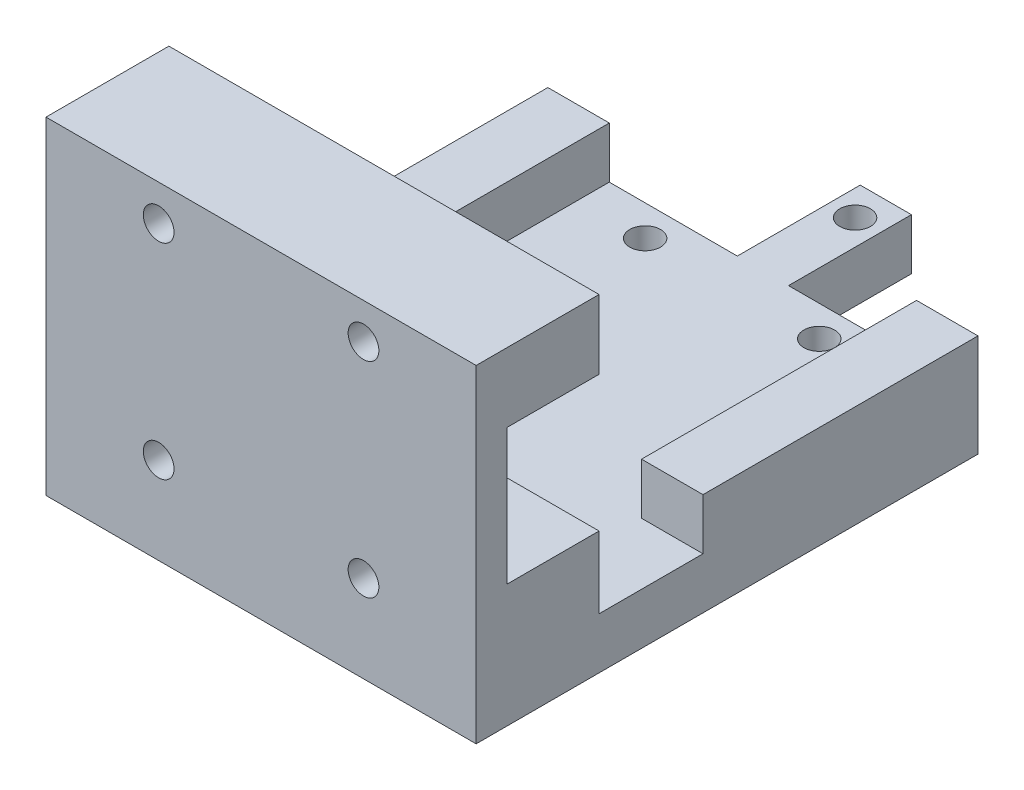
ISO-10303-21;
HEADER;
FILE_DESCRIPTION(('STEP AP214'),'2;1');
FILE_NAME('part.step','',(''),(''),'','','');
FILE_SCHEMA(('AUTOMOTIVE_DESIGN { 1 0 10303 214 1 1 1 1 }'));
ENDSEC;
DATA;
#1=APPLICATION_CONTEXT('core data for automotive mechanical design processes');
#2=APPLICATION_PROTOCOL_DEFINITION('international standard','automotive_design',2000,#1);
#3=PRODUCT_CONTEXT('',#1,'mechanical');
#4=PRODUCT('Part','Part','',(#3));
#5=PRODUCT_RELATED_PRODUCT_CATEGORY('part','',(#4));
#6=PRODUCT_DEFINITION_FORMATION('','',#4);
#7=PRODUCT_DEFINITION_CONTEXT('part definition',#1,'design');
#8=PRODUCT_DEFINITION('design','',#6,#7);
#9=PRODUCT_DEFINITION_SHAPE('','',#8);
#10=(LENGTH_UNIT() NAMED_UNIT(*) SI_UNIT(.MILLI.,.METRE.));
#11=(NAMED_UNIT(*) PLANE_ANGLE_UNIT() SI_UNIT($,.RADIAN.));
#12=(NAMED_UNIT(*) SI_UNIT($,.STERADIAN.) SOLID_ANGLE_UNIT());
#13=UNCERTAINTY_MEASURE_WITH_UNIT(LENGTH_MEASURE(1.E-05),#10,'distance_accuracy_value','');
#14=(GEOMETRIC_REPRESENTATION_CONTEXT(3) GLOBAL_UNCERTAINTY_ASSIGNED_CONTEXT((#13)) GLOBAL_UNIT_ASSIGNED_CONTEXT((#10,
#11,#12)) REPRESENTATION_CONTEXT('',''));
#15=CARTESIAN_POINT('',(0.,0.,0.));
#16=DIRECTION('',(0.,0.,1.));
#17=DIRECTION('',(1.,0.,0.));
#18=AXIS2_PLACEMENT_3D('',#15,#16,#17);
#19=CARTESIAN_POINT('',(-21.,0.,12.));
#20=DIRECTION('',(-1.,0.,0.));
#21=DIRECTION('',(0.,-1.,0.));
#22=AXIS2_PLACEMENT_3D('',#19,#20,#21);
#23=PLANE('',#22);
#24=DIRECTION('',(0.,1.,0.));
#25=VECTOR('',#24,1.);
#26=CARTESIAN_POINT('',(-21.,0.,0.));
#27=LINE('',#26,#25);
#28=CARTESIAN_POINT('',(-21.,6.75,0.));
#29=VERTEX_POINT('',#28);
#30=CARTESIAN_POINT('',(-21.,13.5,0.));
#31=VERTEX_POINT('',#30);
#32=EDGE_CURVE('E79',#29,#31,#27,.T.);
#33=ORIENTED_EDGE('',*,*,#32,.F.);
#34=DIRECTION('',(0.,0.,-1.));
#35=VECTOR('',#34,1.);
#36=CARTESIAN_POINT('',(-21.,6.75,12.));
#37=LINE('',#36,#35);
#38=CARTESIAN_POINT('',(-21.,6.75,9.));
#39=VERTEX_POINT('',#38);
#40=EDGE_CURVE('E11',#39,#29,#37,.T.);
#41=ORIENTED_EDGE('',*,*,#40,.F.);
#42=DIRECTION('',(0.,1.,0.));
#43=VECTOR('',#42,1.);
#44=CARTESIAN_POINT('',(-21.,0.,9.));
#45=LINE('',#44,#43);
#46=CARTESIAN_POINT('',(-21.,-6.5,9.));
#47=VERTEX_POINT('',#46);
#48=EDGE_CURVE('E119',#47,#39,#45,.T.);
#49=ORIENTED_EDGE('',*,*,#48,.F.);
#50=DIRECTION('',(0.,0.,-1.));
#51=VECTOR('',#50,1.);
#52=CARTESIAN_POINT('',(-21.,-6.5,12.));
#53=LINE('',#52,#51);
#54=CARTESIAN_POINT('',(-21.,-6.5,0.));
#55=VERTEX_POINT('',#54);
#56=EDGE_CURVE('E206',#47,#55,#53,.T.);
#57=ORIENTED_EDGE('',*,*,#56,.T.);
#58=DIRECTION('',(0.,-1.,0.));
#59=VECTOR('',#58,1.);
#60=CARTESIAN_POINT('',(-21.,0.,0.));
#61=LINE('',#60,#59);
#62=CARTESIAN_POINT('',(-21.,-13.5,0.));
#63=VERTEX_POINT('',#62);
#64=EDGE_CURVE('E223',#55,#63,#61,.T.);
#65=ORIENTED_EDGE('',*,*,#64,.T.);
#66=DIRECTION('',(0.,0.,-1.));
#67=VECTOR('',#66,1.);
#68=CARTESIAN_POINT('',(-20.9999999999927,-13.5,0.));
#69=LINE('',#68,#67);
#70=CARTESIAN_POINT('',(-20.9999999999927,-13.5,-10.150000000012));
#71=VERTEX_POINT('',#70);
#72=EDGE_CURVE('E259',#63,#71,#69,.T.);
#73=ORIENTED_EDGE('',*,*,#72,.T.);
#74=DIRECTION('',(0.,-1.,0.));
#75=VECTOR('',#74,1.);
#76=CARTESIAN_POINT('',(-20.9999999999927,-8.49999999999999,-10.150000000012));
#77=LINE('',#76,#75);
#78=CARTESIAN_POINT('',(-20.9999999999927,-8.49999999999999,-10.150000000012));
#79=VERTEX_POINT('',#78);
#80=EDGE_CURVE('E278',#79,#71,#77,.T.);
#81=ORIENTED_EDGE('',*,*,#80,.F.);
#82=DIRECTION('',(0.,0.,-1.));
#83=VECTOR('',#82,1.);
#84=CARTESIAN_POINT('',(-20.9999999999927,-8.49999999999999,0.));
#85=LINE('',#84,#83);
#86=CARTESIAN_POINT('',(-20.9999999999927,-8.49999999999999,-36.9999999999998));
#87=VERTEX_POINT('',#86);
#88=EDGE_CURVE('E307',#79,#87,#85,.T.);
#89=ORIENTED_EDGE('',*,*,#88,.T.);
#90=DIRECTION('',(0.,1.,0.));
#91=VECTOR('',#90,1.);
#92=CARTESIAN_POINT('',(-20.9999999999927,-18.5,-36.9999999999998));
#93=LINE('',#92,#91);
#94=CARTESIAN_POINT('',(-20.9999999999927,-18.5,-36.9999999999998));
#95=VERTEX_POINT('',#94);
#96=EDGE_CURVE('E245',#95,#87,#93,.T.);
#97=ORIENTED_EDGE('',*,*,#96,.F.);
#98=DIRECTION('',(0.,0.,-1.));
#99=VECTOR('',#98,1.);
#100=CARTESIAN_POINT('',(-20.9999999999927,-18.5,0.));
#101=LINE('',#100,#99);
#102=CARTESIAN_POINT('',(-21.,-18.5,12.));
#103=VERTEX_POINT('',#102);
#104=EDGE_CURVE('E285',#103,#95,#101,.T.);
#105=ORIENTED_EDGE('',*,*,#104,.F.);
#106=DIRECTION('',(0.,1.,0.));
#107=VECTOR('',#106,1.);
#108=CARTESIAN_POINT('',(-21.,0.,12.));
#109=LINE('',#108,#107);
#110=CARTESIAN_POINT('',(-21.,13.5,12.));
#111=VERTEX_POINT('',#110);
#112=EDGE_CURVE('E82',#103,#111,#109,.T.);
#113=ORIENTED_EDGE('',*,*,#112,.T.);
#114=DIRECTION('',(0.,0.,-1.));
#115=VECTOR('',#114,1.);
#116=CARTESIAN_POINT('',(-21.,13.5,12.));
#117=LINE('',#116,#115);
#118=EDGE_CURVE('E76',#111,#31,#117,.T.);
#119=ORIENTED_EDGE('',*,*,#118,.T.);
#120=EDGE_LOOP('',(#33,#41,#49,#57,#65,#73,#81,#89,#97,#105,#113,#119));
#121=FACE_BOUND('',#120,.T.);
#122=ADVANCED_FACE('F35',(#121),#23,.T.);
#123=CARTESIAN_POINT('',(0.,6.75,12.));
#124=DIRECTION('',(0.,-1.,0.));
#125=DIRECTION('',(0.,0.,-1.));
#126=AXIS2_PLACEMENT_3D('',#123,#124,#125);
#127=PLANE('',#126);
#128=DIRECTION('',(1.,0.,0.));
#129=VECTOR('',#128,1.);
#130=CARTESIAN_POINT('',(0.,6.75,9.));
#131=LINE('',#130,#129);
#132=CARTESIAN_POINT('',(21.0000000000001,6.75,9.));
#133=VERTEX_POINT('',#132);
#134=EDGE_CURVE('E49',#39,#133,#131,.T.);
#135=ORIENTED_EDGE('',*,*,#134,.F.);
#136=ORIENTED_EDGE('',*,*,#40,.T.);
#137=DIRECTION('',(-1.,0.,0.));
#138=VECTOR('',#137,1.);
#139=CARTESIAN_POINT('',(0.,6.75,0.));
#140=LINE('',#139,#138);
#141=CARTESIAN_POINT('',(21.0000000000001,6.75,0.));
#142=VERTEX_POINT('',#141);
#143=EDGE_CURVE('E98',#142,#29,#140,.T.);
#144=ORIENTED_EDGE('',*,*,#143,.F.);
#145=DIRECTION('',(0.,0.,-1.));
#146=VECTOR('',#145,1.);
#147=CARTESIAN_POINT('',(21.0000000000001,6.75,12.));
#148=LINE('',#147,#146);
#149=EDGE_CURVE('E43',#133,#142,#148,.T.);
#150=ORIENTED_EDGE('',*,*,#149,.F.);
#151=EDGE_LOOP('',(#135,#136,#144,#150));
#152=FACE_BOUND('',#151,.T.);
#153=ADVANCED_FACE('F115',(#152),#127,.T.);
#154=CARTESIAN_POINT('',(21.0000000000001,0.,12.));
#155=DIRECTION('',(-1.,0.,0.));
#156=DIRECTION('',(0.,-1.,0.));
#157=AXIS2_PLACEMENT_3D('',#154,#155,#156);
#158=PLANE('',#157);
#159=DIRECTION('',(0.,1.,0.));
#160=VECTOR('',#159,1.);
#161=CARTESIAN_POINT('',(21.0000000000001,0.,0.));
#162=LINE('',#161,#160);
#163=CARTESIAN_POINT('',(21.0000000000001,13.5,0.));
#164=VERTEX_POINT('',#163);
#165=EDGE_CURVE('E94',#142,#164,#162,.T.);
#166=ORIENTED_EDGE('',*,*,#165,.T.);
#167=DIRECTION('',(0.,0.,-1.));
#168=VECTOR('',#167,1.);
#169=CARTESIAN_POINT('',(21.0000000000001,13.5,12.));
#170=LINE('',#169,#168);
#171=CARTESIAN_POINT('',(21.0000000000001,13.5,12.));
#172=VERTEX_POINT('',#171);
#173=EDGE_CURVE('E84',#172,#164,#170,.T.);
#174=ORIENTED_EDGE('',*,*,#173,.F.);
#175=DIRECTION('',(0.,1.,0.));
#176=VECTOR('',#175,1.);
#177=CARTESIAN_POINT('',(21.0000000000001,0.,12.));
#178=LINE('',#177,#176);
#179=CARTESIAN_POINT('',(21.0000000000001,-18.5,12.));
#180=VERTEX_POINT('',#179);
#181=EDGE_CURVE('E137',#180,#172,#178,.T.);
#182=ORIENTED_EDGE('',*,*,#181,.F.);
#183=DIRECTION('',(0.,0.,-1.));
#184=VECTOR('',#183,1.);
#185=CARTESIAN_POINT('',(21.0000000000001,-18.5,0.));
#186=LINE('',#185,#184);
#187=CARTESIAN_POINT('',(21.0000000000001,-18.5,-36.9999999999998));
#188=VERTEX_POINT('',#187);
#189=EDGE_CURVE('E150',#180,#188,#186,.T.);
#190=ORIENTED_EDGE('',*,*,#189,.T.);
#191=DIRECTION('',(0.,1.,0.));
#192=VECTOR('',#191,1.);
#193=CARTESIAN_POINT('',(21.0000000000001,-18.5,-36.9999999999998));
#194=LINE('',#193,#192);
#195=CARTESIAN_POINT('',(21.0000000000001,-8.49999999999999,-36.9999999999998));
#196=VERTEX_POINT('',#195);
#197=EDGE_CURVE('E243',#188,#196,#194,.T.);
#198=ORIENTED_EDGE('',*,*,#197,.T.);
#199=DIRECTION('',(0.,0.,-1.));
#200=VECTOR('',#199,1.);
#201=CARTESIAN_POINT('',(21.0000000000001,-8.49999999999999,0.));
#202=LINE('',#201,#200);
#203=CARTESIAN_POINT('',(21.0000000000001,-8.49999999999999,-10.150000000012));
#204=VERTEX_POINT('',#203);
#205=EDGE_CURVE('E346',#204,#196,#202,.T.);
#206=ORIENTED_EDGE('',*,*,#205,.F.);
#207=DIRECTION('',(0.,-1.,0.));
#208=VECTOR('',#207,1.);
#209=CARTESIAN_POINT('',(21.0000000000001,-8.49999999999999,-10.150000000012));
#210=LINE('',#209,#208);
#211=CARTESIAN_POINT('',(21.0000000000001,-13.5,-10.1500000000116));
#212=VERTEX_POINT('',#211);
#213=EDGE_CURVE('E332',#204,#212,#210,.T.);
#214=ORIENTED_EDGE('',*,*,#213,.T.);
#215=DIRECTION('',(0.,0.,-1.));
#216=VECTOR('',#215,1.);
#217=CARTESIAN_POINT('',(21.0000000000001,-13.5,0.));
#218=LINE('',#217,#216);
#219=CARTESIAN_POINT('',(21.0000000000001,-13.5,0.));
#220=VERTEX_POINT('',#219);
#221=EDGE_CURVE('E262',#220,#212,#218,.T.);
#222=ORIENTED_EDGE('',*,*,#221,.F.);
#223=DIRECTION('',(0.,-1.,0.));
#224=VECTOR('',#223,1.);
#225=CARTESIAN_POINT('',(21.0000000000001,0.,0.));
#226=LINE('',#225,#224);
#227=CARTESIAN_POINT('',(21.0000000000001,-6.5,0.));
#228=VERTEX_POINT('',#227);
#229=EDGE_CURVE('E211',#228,#220,#226,.T.);
#230=ORIENTED_EDGE('',*,*,#229,.F.);
#231=DIRECTION('',(0.,0.,-1.));
#232=VECTOR('',#231,1.);
#233=CARTESIAN_POINT('',(21.0000000000001,-6.5,12.));
#234=LINE('',#233,#232);
#235=CARTESIAN_POINT('',(21.0000000000001,-6.5,9.));
#236=VERTEX_POINT('',#235);
#237=EDGE_CURVE('E204',#236,#228,#234,.T.);
#238=ORIENTED_EDGE('',*,*,#237,.F.);
#239=DIRECTION('',(0.,1.,0.));
#240=VECTOR('',#239,1.);
#241=CARTESIAN_POINT('',(21.0000000000001,0.,9.));
#242=LINE('',#241,#240);
#243=EDGE_CURVE('E114',#236,#133,#242,.T.);
#244=ORIENTED_EDGE('',*,*,#243,.T.);
#245=ORIENTED_EDGE('',*,*,#149,.T.);
#246=EDGE_LOOP('',(#166,#174,#182,#190,#198,#206,#214,#222,#230,#238,#244,#245));
#247=FACE_BOUND('',#246,.T.);
#248=ADVANCED_FACE('F110',(#247),#158,.F.);
#249=CARTESIAN_POINT('',(-10.,10.,12.));
#250=DIRECTION('',(0.,0.,-1.));
#251=DIRECTION('',(-1.,0.,0.));
#252=AXIS2_PLACEMENT_3D('',#249,#250,#251);
#253=CYLINDRICAL_SURFACE('',#252,1.5);
#254=CARTESIAN_POINT('',(-10.,10.,12.));
#255=DIRECTION('',(0.,0.,1.));
#256=DIRECTION('',(1.,0.,0.));
#257=AXIS2_PLACEMENT_3D('',#254,#255,#256);
#258=CIRCLE('',#257,1.5);
#259=CARTESIAN_POINT('',(-8.5,10.,12.));
#260=VERTEX_POINT('',#259);
#261=EDGE_CURVE('E133',#260,#260,#258,.T.);
#262=ORIENTED_EDGE('',*,*,#261,.T.);
#263=EDGE_LOOP('',(#262));
#264=FACE_BOUND('',#263,.T.);
#265=CARTESIAN_POINT('',(-10.,10.,0.));
#266=DIRECTION('',(0.,0.,1.));
#267=DIRECTION('',(1.,0.,0.));
#268=AXIS2_PLACEMENT_3D('',#265,#266,#267);
#269=CIRCLE('',#268,1.5);
#270=CARTESIAN_POINT('',(-8.5,10.,0.));
#271=VERTEX_POINT('',#270);
#272=EDGE_CURVE('E99',#271,#271,#269,.T.);
#273=ORIENTED_EDGE('',*,*,#272,.F.);
#274=EDGE_LOOP('',(#273));
#275=FACE_BOUND('',#274,.T.);
#276=ADVANCED_FACE('F459',(#264,#275),#253,.F.);
#277=CARTESIAN_POINT('',(10.,10.,12.));
#278=DIRECTION('',(0.,0.,-1.));
#279=DIRECTION('',(-1.,0.,0.));
#280=AXIS2_PLACEMENT_3D('',#277,#278,#279);
#281=CYLINDRICAL_SURFACE('',#280,1.5);
#282=CARTESIAN_POINT('',(10.,10.,12.));
#283=DIRECTION('',(0.,0.,1.));
#284=DIRECTION('',(1.,0.,0.));
#285=AXIS2_PLACEMENT_3D('',#282,#283,#284);
#286=CIRCLE('',#285,1.5);
#287=CARTESIAN_POINT('',(11.5,10.,12.));
#288=VERTEX_POINT('',#287);
#289=EDGE_CURVE('E93',#288,#288,#286,.T.);
#290=ORIENTED_EDGE('',*,*,#289,.T.);
#291=EDGE_LOOP('',(#290));
#292=FACE_BOUND('',#291,.T.);
#293=CARTESIAN_POINT('',(10.,10.,0.));
#294=DIRECTION('',(0.,0.,1.));
#295=DIRECTION('',(1.,0.,0.));
#296=AXIS2_PLACEMENT_3D('',#293,#294,#295);
#297=CIRCLE('',#296,1.5);
#298=CARTESIAN_POINT('',(11.5,10.,0.));
#299=VERTEX_POINT('',#298);
#300=EDGE_CURVE('E103',#299,#299,#297,.T.);
#301=ORIENTED_EDGE('',*,*,#300,.F.);
#302=EDGE_LOOP('',(#301));
#303=FACE_BOUND('',#302,.T.);
#304=ADVANCED_FACE('F37',(#292,#303),#281,.F.);
#305=CARTESIAN_POINT('',(0.,13.5,12.));
#306=DIRECTION('',(0.,-1.,0.));
#307=DIRECTION('',(1.,0.,0.));
#308=AXIS2_PLACEMENT_3D('',#305,#306,#307);
#309=PLANE('',#308);
#310=DIRECTION('',(-1.,0.,0.));
#311=VECTOR('',#310,1.);
#312=CARTESIAN_POINT('',(0.,13.5,0.));
#313=LINE('',#312,#311);
#314=EDGE_CURVE('E87',#164,#31,#313,.T.);
#315=ORIENTED_EDGE('',*,*,#314,.T.);
#316=ORIENTED_EDGE('',*,*,#118,.F.);
#317=DIRECTION('',(-1.,0.,0.));
#318=VECTOR('',#317,1.);
#319=CARTESIAN_POINT('',(0.,13.5,12.));
#320=LINE('',#319,#318);
#321=EDGE_CURVE('E58',#172,#111,#320,.T.);
#322=ORIENTED_EDGE('',*,*,#321,.F.);
#323=ORIENTED_EDGE('',*,*,#173,.T.);
#324=EDGE_LOOP('',(#315,#316,#322,#323));
#325=FACE_BOUND('',#324,.T.);
#326=ADVANCED_FACE('F88',(#325),#309,.F.);
#327=CARTESIAN_POINT('',(0.,0.,12.));
#328=DIRECTION('',(0.,0.,1.));
#329=DIRECTION('',(1.,0.,0.));
#330=AXIS2_PLACEMENT_3D('',#327,#328,#329);
#331=PLANE('',#330);
#332=ORIENTED_EDGE('',*,*,#289,.F.);
#333=EDGE_LOOP('',(#332));
#334=FACE_BOUND('',#333,.T.);
#335=ORIENTED_EDGE('',*,*,#261,.F.);
#336=EDGE_LOOP('',(#335));
#337=FACE_BOUND('',#336,.T.);
#338=ORIENTED_EDGE('',*,*,#112,.F.);
#339=DIRECTION('',(-1.,0.,0.));
#340=VECTOR('',#339,1.);
#341=CARTESIAN_POINT('',(0.,-18.5,12.));
#342=LINE('',#341,#340);
#343=EDGE_CURVE('E145',#180,#103,#342,.T.);
#344=ORIENTED_EDGE('',*,*,#343,.F.);
#345=ORIENTED_EDGE('',*,*,#181,.T.);
#346=ORIENTED_EDGE('',*,*,#321,.T.);
#347=EDGE_LOOP('',(#338,#344,#345,#346));
#348=FACE_BOUND('',#347,.T.);
#349=CARTESIAN_POINT('',(-10.,-10.,12.));
#350=DIRECTION('',(0.,0.,1.));
#351=DIRECTION('',(1.,0.,0.));
#352=AXIS2_PLACEMENT_3D('',#349,#350,#351);
#353=CIRCLE('',#352,1.5);
#354=CARTESIAN_POINT('',(-8.5,-10.,12.));
#355=VERTEX_POINT('',#354);
#356=EDGE_CURVE('E216',#355,#355,#353,.T.);
#357=ORIENTED_EDGE('',*,*,#356,.F.);
#358=EDGE_LOOP('',(#357));
#359=FACE_BOUND('',#358,.T.);
#360=CARTESIAN_POINT('',(10.,-9.99999999999999,12.));
#361=DIRECTION('',(0.,0.,1.));
#362=DIRECTION('',(1.,0.,0.));
#363=AXIS2_PLACEMENT_3D('',#360,#361,#362);
#364=CIRCLE('',#363,1.5);
#365=CARTESIAN_POINT('',(11.5,-9.99999999999999,12.));
#366=VERTEX_POINT('',#365);
#367=EDGE_CURVE('E212',#366,#366,#364,.T.);
#368=ORIENTED_EDGE('',*,*,#367,.F.);
#369=EDGE_LOOP('',(#368));
#370=FACE_BOUND('',#369,.T.);
#371=ADVANCED_FACE('F141',(#334,#337,#348,#359,#370),#331,.T.);
#372=CARTESIAN_POINT('',(0.,0.,0.));
#373=DIRECTION('',(0.,0.,1.));
#374=DIRECTION('',(1.,0.,0.));
#375=AXIS2_PLACEMENT_3D('',#372,#373,#374);
#376=PLANE('',#375);
#377=ORIENTED_EDGE('',*,*,#300,.T.);
#378=EDGE_LOOP('',(#377));
#379=FACE_BOUND('',#378,.T.);
#380=ORIENTED_EDGE('',*,*,#272,.T.);
#381=EDGE_LOOP('',(#380));
#382=FACE_BOUND('',#381,.T.);
#383=ORIENTED_EDGE('',*,*,#32,.T.);
#384=ORIENTED_EDGE('',*,*,#314,.F.);
#385=ORIENTED_EDGE('',*,*,#165,.F.);
#386=ORIENTED_EDGE('',*,*,#143,.T.);
#387=EDGE_LOOP('',(#383,#384,#385,#386));
#388=FACE_BOUND('',#387,.T.);
#389=ADVANCED_FACE('F96',(#379,#382,#388),#376,.F.);
#390=CARTESIAN_POINT('',(0.,0.,9.));
#391=DIRECTION('',(0.,0.,1.));
#392=DIRECTION('',(1.,0.,0.));
#393=AXIS2_PLACEMENT_3D('',#390,#391,#392);
#394=PLANE('',#393);
#395=DIRECTION('',(1.,0.,0.));
#396=VECTOR('',#395,1.);
#397=CARTESIAN_POINT('',(0.,-6.5,9.));
#398=LINE('',#397,#396);
#399=EDGE_CURVE('E124',#47,#236,#398,.T.);
#400=ORIENTED_EDGE('',*,*,#399,.F.);
#401=ORIENTED_EDGE('',*,*,#48,.T.);
#402=ORIENTED_EDGE('',*,*,#134,.T.);
#403=ORIENTED_EDGE('',*,*,#243,.F.);
#404=EDGE_LOOP('',(#400,#401,#402,#403));
#405=FACE_BOUND('',#404,.T.);
#406=ADVANCED_FACE('F122',(#405),#394,.F.);
#407=CARTESIAN_POINT('',(0.,-6.5,12.));
#408=DIRECTION('',(0.,-1.,0.));
#409=DIRECTION('',(0.,0.,-1.));
#410=AXIS2_PLACEMENT_3D('',#407,#408,#409);
#411=PLANE('',#410);
#412=ORIENTED_EDGE('',*,*,#56,.F.);
#413=ORIENTED_EDGE('',*,*,#399,.T.);
#414=ORIENTED_EDGE('',*,*,#237,.T.);
#415=DIRECTION('',(-1.,0.,0.));
#416=VECTOR('',#415,1.);
#417=CARTESIAN_POINT('',(0.,-6.5,0.));
#418=LINE('',#417,#416);
#419=EDGE_CURVE('E226',#228,#55,#418,.T.);
#420=ORIENTED_EDGE('',*,*,#419,.T.);
#421=EDGE_LOOP('',(#412,#413,#414,#420));
#422=FACE_BOUND('',#421,.T.);
#423=ADVANCED_FACE('F202',(#422),#411,.F.);
#424=CARTESIAN_POINT('',(0.,-13.5,0.));
#425=DIRECTION('',(0.,-1.,0.));
#426=DIRECTION('',(0.,0.,-1.));
#427=AXIS2_PLACEMENT_3D('',#424,#425,#426);
#428=PLANE('',#427);
#429=CARTESIAN_POINT('',(-5.88662672838027E-12,-13.5,-45.9999999999997));
#430=DIRECTION('',(0.,-1.,0.));
#431=DIRECTION('',(0.,0.,-1.));
#432=AXIS2_PLACEMENT_3D('',#429,#430,#431);
#433=CIRCLE('',#432,1.5000000000057);
#434=CARTESIAN_POINT('',(-5.88662672838027E-12,-13.5,-47.5000000000054));
#435=VERTEX_POINT('',#434);
#436=EDGE_CURVE('E275',#435,#435,#433,.T.);
#437=ORIENTED_EDGE('',*,*,#436,.T.);
#438=EDGE_LOOP('',(#437));
#439=FACE_BOUND('',#438,.T.);
#440=CARTESIAN_POINT('',(-8.50000000000587,-13.5,-33.9999999999997));
#441=DIRECTION('',(0.,-1.,0.));
#442=DIRECTION('',(0.,0.,-1.));
#443=AXIS2_PLACEMENT_3D('',#440,#441,#442);
#444=CIRCLE('',#443,1.5000000000057);
#445=CARTESIAN_POINT('',(-8.50000000000587,-13.5,-35.5000000000054));
#446=VERTEX_POINT('',#445);
#447=EDGE_CURVE('E255',#446,#446,#444,.T.);
#448=ORIENTED_EDGE('',*,*,#447,.T.);
#449=EDGE_LOOP('',(#448));
#450=FACE_BOUND('',#449,.T.);
#451=CARTESIAN_POINT('',(8.49999999999413,-13.5,-33.9999999999997));
#452=DIRECTION('',(0.,-1.,0.));
#453=DIRECTION('',(0.,0.,-1.));
#454=AXIS2_PLACEMENT_3D('',#451,#452,#453);
#455=CIRCLE('',#454,1.5000000000057);
#456=CARTESIAN_POINT('',(8.49999999999413,-13.5,-35.5000000000054));
#457=VERTEX_POINT('',#456);
#458=EDGE_CURVE('E251',#457,#457,#455,.T.);
#459=ORIENTED_EDGE('',*,*,#458,.T.);
#460=EDGE_LOOP('',(#459));
#461=FACE_BOUND('',#460,.T.);
#462=DIRECTION('',(0.,0.,1.));
#463=VECTOR('',#462,1.);
#464=CARTESIAN_POINT('',(14.9999999999941,-13.5,0.));
#465=LINE('',#464,#463);
#466=CARTESIAN_POINT('',(14.9999999999941,-13.5,-36.9999999999998));
#467=VERTEX_POINT('',#466);
#468=CARTESIAN_POINT('',(14.9999999999941,-13.5,-10.1500000000116));
#469=VERTEX_POINT('',#468);
#470=EDGE_CURVE('E341',#467,#469,#465,.T.);
#471=ORIENTED_EDGE('',*,*,#470,.F.);
#472=DIRECTION('',(-1.,0.,0.));
#473=VECTOR('',#472,1.);
#474=CARTESIAN_POINT('',(0.,-13.5,-36.9999999999998));
#475=LINE('',#474,#473);
#476=CARTESIAN_POINT('',(2.49999999999411,-13.5,-36.9999999999998));
#477=VERTEX_POINT('',#476);
#478=EDGE_CURVE('E264',#467,#477,#475,.T.);
#479=ORIENTED_EDGE('',*,*,#478,.T.);
#480=DIRECTION('',(0.,0.,-1.));
#481=VECTOR('',#480,1.);
#482=CARTESIAN_POINT('',(2.49999999999411,-13.5,0.));
#483=LINE('',#482,#481);
#484=CARTESIAN_POINT('',(2.49999999999412,-13.5,-48.9999999999997));
#485=VERTEX_POINT('',#484);
#486=EDGE_CURVE('E266',#477,#485,#483,.T.);
#487=ORIENTED_EDGE('',*,*,#486,.T.);
#488=DIRECTION('',(-1.,0.,0.));
#489=VECTOR('',#488,1.);
#490=CARTESIAN_POINT('',(0.,-13.5,-48.9999999999997));
#491=LINE('',#490,#489);
#492=CARTESIAN_POINT('',(-2.50000000000588,-13.5,-48.9999999999997));
#493=VERTEX_POINT('',#492);
#494=EDGE_CURVE('E269',#485,#493,#491,.T.);
#495=ORIENTED_EDGE('',*,*,#494,.T.);
#496=DIRECTION('',(0.,0.,1.));
#497=VECTOR('',#496,1.);
#498=CARTESIAN_POINT('',(-2.50000000000588,-13.5,0.));
#499=LINE('',#498,#497);
#500=CARTESIAN_POINT('',(-2.50000000000588,-13.5,-36.9999999999998));
#501=VERTEX_POINT('',#500);
#502=EDGE_CURVE('E272',#493,#501,#499,.T.);
#503=ORIENTED_EDGE('',*,*,#502,.T.);
#504=CARTESIAN_POINT('',(-15.0000000000059,-13.5,-36.9999999999998));
#505=VERTEX_POINT('',#504);
#506=EDGE_CURVE('E258',#501,#505,#475,.T.);
#507=ORIENTED_EDGE('',*,*,#506,.T.);
#508=DIRECTION('',(0.,0.,1.));
#509=VECTOR('',#508,1.);
#510=CARTESIAN_POINT('',(-15.0000000000059,-13.5,0.));
#511=LINE('',#510,#509);
#512=CARTESIAN_POINT('',(-15.0000000000059,-13.5,-10.1500000000116));
#513=VERTEX_POINT('',#512);
#514=EDGE_CURVE('E315',#505,#513,#511,.T.);
#515=ORIENTED_EDGE('',*,*,#514,.T.);
#516=DIRECTION('',(1.,0.,0.));
#517=VECTOR('',#516,1.);
#518=CARTESIAN_POINT('',(5.63438184999108E-13,-13.5,-10.1500000000108));
#519=LINE('',#518,#517);
#520=EDGE_CURVE('E312',#71,#513,#519,.T.);
#521=ORIENTED_EDGE('',*,*,#520,.F.);
#522=ORIENTED_EDGE('',*,*,#72,.F.);
#523=DIRECTION('',(-1.,0.,0.));
#524=VECTOR('',#523,1.);
#525=CARTESIAN_POINT('',(0.,-13.5,0.));
#526=LINE('',#525,#524);
#527=EDGE_CURVE('E220',#220,#63,#526,.T.);
#528=ORIENTED_EDGE('',*,*,#527,.F.);
#529=ORIENTED_EDGE('',*,*,#221,.T.);
#530=DIRECTION('',(-1.,0.,0.));
#531=VECTOR('',#530,1.);
#532=CARTESIAN_POINT('',(-5.63438184997305E-13,-13.5,-10.1500000000108));
#533=LINE('',#532,#531);
#534=EDGE_CURVE('E338',#212,#469,#533,.T.);
#535=ORIENTED_EDGE('',*,*,#534,.T.);
#536=EDGE_LOOP('',(#471,#479,#487,#495,#503,#507,#515,#521,#522,#528,#529,#535));
#537=FACE_BOUND('',#536,.T.);
#538=ADVANCED_FACE('F416',(#439,#450,#461,#537),#428,.F.);
#539=CARTESIAN_POINT('',(10.,-9.99999999999999,12.));
#540=DIRECTION('',(0.,0.,-1.));
#541=DIRECTION('',(-1.,0.,0.));
#542=AXIS2_PLACEMENT_3D('',#539,#540,#541);
#543=CYLINDRICAL_SURFACE('',#542,1.5);
#544=ORIENTED_EDGE('',*,*,#367,.T.);
#545=EDGE_LOOP('',(#544));
#546=FACE_BOUND('',#545,.T.);
#547=CARTESIAN_POINT('',(10.,-9.99999999999999,0.));
#548=DIRECTION('',(0.,0.,1.));
#549=DIRECTION('',(1.,0.,0.));
#550=AXIS2_PLACEMENT_3D('',#547,#548,#549);
#551=CIRCLE('',#550,1.5);
#552=CARTESIAN_POINT('',(11.5,-9.99999999999999,0.));
#553=VERTEX_POINT('',#552);
#554=EDGE_CURVE('E228',#553,#553,#551,.T.);
#555=ORIENTED_EDGE('',*,*,#554,.F.);
#556=EDGE_LOOP('',(#555));
#557=FACE_BOUND('',#556,.T.);
#558=ADVANCED_FACE('F521',(#546,#557),#543,.F.);
#559=CARTESIAN_POINT('',(-10.,-10.,12.));
#560=DIRECTION('',(0.,0.,-1.));
#561=DIRECTION('',(-1.,0.,0.));
#562=AXIS2_PLACEMENT_3D('',#559,#560,#561);
#563=CYLINDRICAL_SURFACE('',#562,1.5);
#564=ORIENTED_EDGE('',*,*,#356,.T.);
#565=EDGE_LOOP('',(#564));
#566=FACE_BOUND('',#565,.T.);
#567=CARTESIAN_POINT('',(-10.,-10.,0.));
#568=DIRECTION('',(0.,0.,1.));
#569=DIRECTION('',(1.,0.,0.));
#570=AXIS2_PLACEMENT_3D('',#567,#568,#569);
#571=CIRCLE('',#570,1.5);
#572=CARTESIAN_POINT('',(-8.5,-10.,0.));
#573=VERTEX_POINT('',#572);
#574=EDGE_CURVE('E231',#573,#573,#571,.T.);
#575=ORIENTED_EDGE('',*,*,#574,.F.);
#576=EDGE_LOOP('',(#575));
#577=FACE_BOUND('',#576,.T.);
#578=ADVANCED_FACE('F448',(#566,#577),#563,.F.);
#579=CARTESIAN_POINT('',(0.,0.,0.));
#580=DIRECTION('',(0.,0.,1.));
#581=DIRECTION('',(1.,0.,0.));
#582=AXIS2_PLACEMENT_3D('',#579,#580,#581);
#583=PLANE('',#582);
#584=ORIENTED_EDGE('',*,*,#574,.T.);
#585=EDGE_LOOP('',(#584));
#586=FACE_BOUND('',#585,.T.);
#587=ORIENTED_EDGE('',*,*,#554,.T.);
#588=EDGE_LOOP('',(#587));
#589=FACE_BOUND('',#588,.T.);
#590=ORIENTED_EDGE('',*,*,#419,.F.);
#591=ORIENTED_EDGE('',*,*,#229,.T.);
#592=ORIENTED_EDGE('',*,*,#527,.T.);
#593=ORIENTED_EDGE('',*,*,#64,.F.);
#594=EDGE_LOOP('',(#590,#591,#592,#593));
#595=FACE_BOUND('',#594,.T.);
#596=ADVANCED_FACE('F418',(#586,#589,#595),#583,.F.);
#597=CARTESIAN_POINT('',(-2.50000000000588,-18.5,0.));
#598=DIRECTION('',(-1.,0.,0.));
#599=DIRECTION('',(0.,0.,1.));
#600=AXIS2_PLACEMENT_3D('',#597,#598,#599);
#601=PLANE('',#600);
#602=ORIENTED_EDGE('',*,*,#502,.F.);
#603=DIRECTION('',(0.,1.,0.));
#604=VECTOR('',#603,1.);
#605=CARTESIAN_POINT('',(-2.50000000000588,-18.5,-48.9999999999997));
#606=LINE('',#605,#604);
#607=CARTESIAN_POINT('',(-2.50000000000588,-18.5,-48.9999999999997));
#608=VERTEX_POINT('',#607);
#609=EDGE_CURVE('E233',#608,#493,#606,.T.);
#610=ORIENTED_EDGE('',*,*,#609,.F.);
#611=DIRECTION('',(0.,0.,1.));
#612=VECTOR('',#611,1.);
#613=CARTESIAN_POINT('',(-2.50000000000588,-18.5,0.));
#614=LINE('',#613,#612);
#615=CARTESIAN_POINT('',(-2.50000000000588,-18.5,-36.9999999999998));
#616=VERTEX_POINT('',#615);
#617=EDGE_CURVE('E298',#608,#616,#614,.T.);
#618=ORIENTED_EDGE('',*,*,#617,.T.);
#619=DIRECTION('',(0.,1.,0.));
#620=VECTOR('',#619,1.);
#621=CARTESIAN_POINT('',(-2.50000000000588,-18.5,-36.9999999999998));
#622=LINE('',#621,#620);
#623=EDGE_CURVE('E248',#616,#501,#622,.T.);
#624=ORIENTED_EDGE('',*,*,#623,.T.);
#625=EDGE_LOOP('',(#602,#610,#618,#624));
#626=FACE_BOUND('',#625,.T.);
#627=ADVANCED_FACE('F440',(#626),#601,.T.);
#628=CARTESIAN_POINT('',(0.,-18.5,-48.9999999999997));
#629=DIRECTION('',(0.,0.,-1.));
#630=DIRECTION('',(-1.,0.,0.));
#631=AXIS2_PLACEMENT_3D('',#628,#629,#630);
#632=PLANE('',#631);
#633=ORIENTED_EDGE('',*,*,#494,.F.);
#634=DIRECTION('',(0.,1.,0.));
#635=VECTOR('',#634,1.);
#636=CARTESIAN_POINT('',(2.49999999999412,-18.5,-48.9999999999997));
#637=LINE('',#636,#635);
#638=CARTESIAN_POINT('',(2.49999999999412,-18.5,-48.9999999999997));
#639=VERTEX_POINT('',#638);
#640=EDGE_CURVE('E238',#639,#485,#637,.T.);
#641=ORIENTED_EDGE('',*,*,#640,.F.);
#642=DIRECTION('',(-1.,0.,0.));
#643=VECTOR('',#642,1.);
#644=CARTESIAN_POINT('',(0.,-18.5,-48.9999999999997));
#645=LINE('',#644,#643);
#646=EDGE_CURVE('E295',#639,#608,#645,.T.);
#647=ORIENTED_EDGE('',*,*,#646,.T.);
#648=ORIENTED_EDGE('',*,*,#609,.T.);
#649=EDGE_LOOP('',(#633,#641,#647,#648));
#650=FACE_BOUND('',#649,.T.);
#651=ADVANCED_FACE('F413',(#650),#632,.T.);
#652=CARTESIAN_POINT('',(2.49999999999411,-18.5,0.));
#653=DIRECTION('',(1.,0.,0.));
#654=DIRECTION('',(0.,0.,-1.));
#655=AXIS2_PLACEMENT_3D('',#652,#653,#654);
#656=PLANE('',#655);
#657=ORIENTED_EDGE('',*,*,#486,.F.);
#658=DIRECTION('',(0.,1.,0.));
#659=VECTOR('',#658,1.);
#660=CARTESIAN_POINT('',(2.49999999999411,-18.5,-36.9999999999998));
#661=LINE('',#660,#659);
#662=CARTESIAN_POINT('',(2.49999999999411,-18.5,-36.9999999999998));
#663=VERTEX_POINT('',#662);
#664=EDGE_CURVE('E240',#663,#477,#661,.T.);
#665=ORIENTED_EDGE('',*,*,#664,.F.);
#666=DIRECTION('',(0.,0.,-1.));
#667=VECTOR('',#666,1.);
#668=CARTESIAN_POINT('',(2.49999999999411,-18.5,0.));
#669=LINE('',#668,#667);
#670=EDGE_CURVE('E292',#663,#639,#669,.T.);
#671=ORIENTED_EDGE('',*,*,#670,.T.);
#672=ORIENTED_EDGE('',*,*,#640,.T.);
#673=EDGE_LOOP('',(#657,#665,#671,#672));
#674=FACE_BOUND('',#673,.T.);
#675=ADVANCED_FACE('F404',(#674),#656,.T.);
#676=CARTESIAN_POINT('',(0.,-18.5,-36.9999999999998));
#677=DIRECTION('',(0.,0.,-1.));
#678=DIRECTION('',(-1.,0.,0.));
#679=AXIS2_PLACEMENT_3D('',#676,#677,#678);
#680=PLANE('',#679);
#681=ORIENTED_EDGE('',*,*,#478,.F.);
#682=DIRECTION('',(0.,-1.,0.));
#683=VECTOR('',#682,1.);
#684=CARTESIAN_POINT('',(14.9999999999941,-8.49999999999999,-36.9999999999998));
#685=LINE('',#684,#683);
#686=CARTESIAN_POINT('',(14.9999999999941,-8.49999999999999,-36.9999999999998));
#687=VERTEX_POINT('',#686);
#688=EDGE_CURVE('E329',#687,#467,#685,.T.);
#689=ORIENTED_EDGE('',*,*,#688,.F.);
#690=DIRECTION('',(-1.,0.,0.));
#691=VECTOR('',#690,1.);
#692=CARTESIAN_POINT('',(0.,-8.49999999999999,-36.9999999999998));
#693=LINE('',#692,#691);
#694=EDGE_CURVE('E349',#196,#687,#693,.T.);
#695=ORIENTED_EDGE('',*,*,#694,.F.);
#696=ORIENTED_EDGE('',*,*,#197,.F.);
#697=DIRECTION('',(-1.,0.,0.));
#698=VECTOR('',#697,1.);
#699=CARTESIAN_POINT('',(0.,-18.5,-36.9999999999998));
#700=LINE('',#699,#698);
#701=EDGE_CURVE('E289',#188,#663,#700,.T.);
#702=ORIENTED_EDGE('',*,*,#701,.T.);
#703=ORIENTED_EDGE('',*,*,#664,.T.);
#704=EDGE_LOOP('',(#681,#689,#695,#696,#702,#703));
#705=FACE_BOUND('',#704,.T.);
#706=ADVANCED_FACE('F378',(#705),#680,.T.);
#707=CARTESIAN_POINT('',(-8.50000000000587,-18.5,-33.9999999999997));
#708=DIRECTION('',(0.,1.,0.));
#709=DIRECTION('',(0.,0.,1.));
#710=AXIS2_PLACEMENT_3D('',#707,#708,#709);
#711=CYLINDRICAL_SURFACE('',#710,1.5000000000057);
#712=CARTESIAN_POINT('',(-8.50000000000587,-18.5,-33.9999999999997));
#713=DIRECTION('',(0.,-1.,0.));
#714=DIRECTION('',(0.,0.,-1.));
#715=AXIS2_PLACEMENT_3D('',#712,#713,#714);
#716=CIRCLE('',#715,1.5000000000057);
#717=CARTESIAN_POINT('',(-8.50000000000587,-18.5,-35.5000000000054));
#718=VERTEX_POINT('',#717);
#719=EDGE_CURVE('E281',#718,#718,#716,.T.);
#720=ORIENTED_EDGE('',*,*,#719,.T.);
#721=EDGE_LOOP('',(#720));
#722=FACE_BOUND('',#721,.T.);
#723=ORIENTED_EDGE('',*,*,#447,.F.);
#724=EDGE_LOOP('',(#723));
#725=FACE_BOUND('',#724,.T.);
#726=ADVANCED_FACE('F575',(#722,#725),#711,.F.);
#727=ORIENTED_EDGE('',*,*,#506,.F.);
#728=ORIENTED_EDGE('',*,*,#623,.F.);
#729=EDGE_CURVE('E284',#616,#95,#700,.T.);
#730=ORIENTED_EDGE('',*,*,#729,.T.);
#731=ORIENTED_EDGE('',*,*,#96,.T.);
#732=DIRECTION('',(-1.,0.,0.));
#733=VECTOR('',#732,1.);
#734=CARTESIAN_POINT('',(0.,-8.49999999999999,-36.9999999999998));
#735=LINE('',#734,#733);
#736=CARTESIAN_POINT('',(-15.0000000000059,-8.49999999999999,-36.9999999999998));
#737=VERTEX_POINT('',#736);
#738=EDGE_CURVE('E314',#737,#87,#735,.T.);
#739=ORIENTED_EDGE('',*,*,#738,.F.);
#740=DIRECTION('',(0.,-1.,0.));
#741=VECTOR('',#740,1.);
#742=CARTESIAN_POINT('',(-15.0000000000059,-8.49999999999999,-36.9999999999998));
#743=LINE('',#742,#741);
#744=EDGE_CURVE('E303',#737,#505,#743,.T.);
#745=ORIENTED_EDGE('',*,*,#744,.T.);
#746=EDGE_LOOP('',(#727,#728,#730,#731,#739,#745));
#747=FACE_BOUND('',#746,.T.);
#748=ADVANCED_FACE('F438',(#747),#680,.T.);
#749=CARTESIAN_POINT('',(-5.88662672838027E-12,-18.5,-45.9999999999997));
#750=DIRECTION('',(0.,1.,0.));
#751=DIRECTION('',(0.,0.,1.));
#752=AXIS2_PLACEMENT_3D('',#749,#750,#751);
#753=CYLINDRICAL_SURFACE('',#752,1.5000000000057);
#754=CARTESIAN_POINT('',(-5.88662672838027E-12,-18.5,-45.9999999999997));
#755=DIRECTION('',(0.,-1.,0.));
#756=DIRECTION('',(0.,0.,-1.));
#757=AXIS2_PLACEMENT_3D('',#754,#755,#756);
#758=CIRCLE('',#757,1.5000000000057);
#759=CARTESIAN_POINT('',(-5.88662672838027E-12,-18.5,-47.5000000000054));
#760=VERTEX_POINT('',#759);
#761=EDGE_CURVE('E254',#760,#760,#758,.T.);
#762=ORIENTED_EDGE('',*,*,#761,.T.);
#763=EDGE_LOOP('',(#762));
#764=FACE_BOUND('',#763,.T.);
#765=ORIENTED_EDGE('',*,*,#436,.F.);
#766=EDGE_LOOP('',(#765));
#767=FACE_BOUND('',#766,.T.);
#768=ADVANCED_FACE('F595',(#764,#767),#753,.F.);
#769=CARTESIAN_POINT('',(8.49999999999413,-18.5,-33.9999999999997));
#770=DIRECTION('',(0.,1.,0.));
#771=DIRECTION('',(0.,0.,1.));
#772=AXIS2_PLACEMENT_3D('',#769,#770,#771);
#773=CYLINDRICAL_SURFACE('',#772,1.5000000000057);
#774=CARTESIAN_POINT('',(8.49999999999413,-18.5,-33.9999999999997));
#775=DIRECTION('',(0.,-1.,0.));
#776=DIRECTION('',(0.,0.,-1.));
#777=AXIS2_PLACEMENT_3D('',#774,#775,#776);
#778=CIRCLE('',#777,1.5000000000057);
#779=CARTESIAN_POINT('',(8.49999999999413,-18.5,-35.5000000000054));
#780=VERTEX_POINT('',#779);
#781=EDGE_CURVE('E250',#780,#780,#778,.T.);
#782=ORIENTED_EDGE('',*,*,#781,.T.);
#783=EDGE_LOOP('',(#782));
#784=FACE_BOUND('',#783,.T.);
#785=ORIENTED_EDGE('',*,*,#458,.F.);
#786=EDGE_LOOP('',(#785));
#787=FACE_BOUND('',#786,.T.);
#788=ADVANCED_FACE('F604',(#784,#787),#773,.F.);
#789=CARTESIAN_POINT('',(0.,-18.5,0.));
#790=DIRECTION('',(0.,-1.,0.));
#791=DIRECTION('',(0.,0.,-1.));
#792=AXIS2_PLACEMENT_3D('',#789,#790,#791);
#793=PLANE('',#792);
#794=ORIENTED_EDGE('',*,*,#761,.F.);
#795=EDGE_LOOP('',(#794));
#796=FACE_BOUND('',#795,.T.);
#797=ORIENTED_EDGE('',*,*,#617,.F.);
#798=ORIENTED_EDGE('',*,*,#646,.F.);
#799=ORIENTED_EDGE('',*,*,#670,.F.);
#800=ORIENTED_EDGE('',*,*,#701,.F.);
#801=ORIENTED_EDGE('',*,*,#189,.F.);
#802=ORIENTED_EDGE('',*,*,#343,.T.);
#803=ORIENTED_EDGE('',*,*,#104,.T.);
#804=ORIENTED_EDGE('',*,*,#729,.F.);
#805=EDGE_LOOP('',(#797,#798,#799,#800,#801,#802,#803,#804));
#806=FACE_BOUND('',#805,.T.);
#807=ORIENTED_EDGE('',*,*,#719,.F.);
#808=EDGE_LOOP('',(#807));
#809=FACE_BOUND('',#808,.T.);
#810=ORIENTED_EDGE('',*,*,#781,.F.);
#811=EDGE_LOOP('',(#810));
#812=FACE_BOUND('',#811,.T.);
#813=ADVANCED_FACE('F408',(#796,#806,#809,#812),#793,.T.);
#814=CARTESIAN_POINT('',(5.63438184999108E-13,-8.49999999999999,-10.1500000000108));
#815=DIRECTION('',(0.,0.,-1.));
#816=DIRECTION('',(-1.,0.,0.));
#817=AXIS2_PLACEMENT_3D('',#814,#815,#816);
#818=PLANE('',#817);
#819=ORIENTED_EDGE('',*,*,#520,.T.);
#820=DIRECTION('',(0.,-1.,0.));
#821=VECTOR('',#820,1.);
#822=CARTESIAN_POINT('',(-15.0000000000059,-8.49999999999999,-10.1500000000116));
#823=LINE('',#822,#821);
#824=CARTESIAN_POINT('',(-15.0000000000059,-8.49999999999999,-10.1500000000116));
#825=VERTEX_POINT('',#824);
#826=EDGE_CURVE('E306',#825,#513,#823,.T.);
#827=ORIENTED_EDGE('',*,*,#826,.F.);
#828=DIRECTION('',(1.,0.,0.));
#829=VECTOR('',#828,1.);
#830=CARTESIAN_POINT('',(5.63438184999108E-13,-8.49999999999999,-10.1500000000108));
#831=LINE('',#830,#829);
#832=EDGE_CURVE('E321',#79,#825,#831,.T.);
#833=ORIENTED_EDGE('',*,*,#832,.F.);
#834=ORIENTED_EDGE('',*,*,#80,.T.);
#835=EDGE_LOOP('',(#819,#827,#833,#834));
#836=FACE_BOUND('',#835,.T.);
#837=ADVANCED_FACE('F426',(#836),#818,.F.);
#838=CARTESIAN_POINT('',(-15.0000000000059,-8.49999999999999,0.));
#839=DIRECTION('',(1.,0.,0.));
#840=DIRECTION('',(0.,0.,-1.));
#841=AXIS2_PLACEMENT_3D('',#838,#839,#840);
#842=PLANE('',#841);
#843=ORIENTED_EDGE('',*,*,#514,.F.);
#844=ORIENTED_EDGE('',*,*,#744,.F.);
#845=DIRECTION('',(0.,0.,1.));
#846=VECTOR('',#845,1.);
#847=CARTESIAN_POINT('',(-15.0000000000059,-8.49999999999999,0.));
#848=LINE('',#847,#846);
#849=EDGE_CURVE('E324',#737,#825,#848,.T.);
#850=ORIENTED_EDGE('',*,*,#849,.T.);
#851=ORIENTED_EDGE('',*,*,#826,.T.);
#852=EDGE_LOOP('',(#843,#844,#850,#851));
#853=FACE_BOUND('',#852,.T.);
#854=ADVANCED_FACE('F428',(#853),#842,.T.);
#855=CARTESIAN_POINT('',(0.,-8.49999999999999,0.));
#856=DIRECTION('',(0.,-1.,0.));
#857=DIRECTION('',(0.,0.,-1.));
#858=AXIS2_PLACEMENT_3D('',#855,#856,#857);
#859=PLANE('',#858);
#860=ORIENTED_EDGE('',*,*,#738,.T.);
#861=ORIENTED_EDGE('',*,*,#88,.F.);
#862=ORIENTED_EDGE('',*,*,#832,.T.);
#863=ORIENTED_EDGE('',*,*,#849,.F.);
#864=EDGE_LOOP('',(#860,#861,#862,#863));
#865=FACE_BOUND('',#864,.T.);
#866=ADVANCED_FACE('F432',(#865),#859,.F.);
#867=CARTESIAN_POINT('',(14.9999999999941,-8.49999999999999,0.));
#868=DIRECTION('',(1.,0.,0.));
#869=DIRECTION('',(0.,0.,-1.));
#870=AXIS2_PLACEMENT_3D('',#867,#868,#869);
#871=PLANE('',#870);
#872=ORIENTED_EDGE('',*,*,#470,.T.);
#873=DIRECTION('',(0.,-1.,0.));
#874=VECTOR('',#873,1.);
#875=CARTESIAN_POINT('',(14.9999999999941,-8.49999999999999,-10.1500000000116));
#876=LINE('',#875,#874);
#877=CARTESIAN_POINT('',(14.9999999999941,-8.49999999999999,-10.1500000000116));
#878=VERTEX_POINT('',#877);
#879=EDGE_CURVE('E318',#878,#469,#876,.T.);
#880=ORIENTED_EDGE('',*,*,#879,.F.);
#881=DIRECTION('',(0.,0.,1.));
#882=VECTOR('',#881,1.);
#883=CARTESIAN_POINT('',(14.9999999999941,-8.49999999999999,0.));
#884=LINE('',#883,#882);
#885=EDGE_CURVE('E340',#687,#878,#884,.T.);
#886=ORIENTED_EDGE('',*,*,#885,.F.);
#887=ORIENTED_EDGE('',*,*,#688,.T.);
#888=EDGE_LOOP('',(#872,#880,#886,#887));
#889=FACE_BOUND('',#888,.T.);
#890=ADVANCED_FACE('F366',(#889),#871,.F.);
#891=CARTESIAN_POINT('',(-5.63438184997305E-13,-8.49999999999999,-10.1500000000108));
#892=DIRECTION('',(0.,0.,1.));
#893=DIRECTION('',(1.,0.,0.));
#894=AXIS2_PLACEMENT_3D('',#891,#892,#893);
#895=PLANE('',#894);
#896=ORIENTED_EDGE('',*,*,#534,.F.);
#897=ORIENTED_EDGE('',*,*,#213,.F.);
#898=DIRECTION('',(-1.,0.,0.));
#899=VECTOR('',#898,1.);
#900=CARTESIAN_POINT('',(-5.63438184997305E-13,-8.49999999999999,-10.1500000000108));
#901=LINE('',#900,#899);
#902=EDGE_CURVE('E333',#204,#878,#901,.T.);
#903=ORIENTED_EDGE('',*,*,#902,.T.);
#904=ORIENTED_EDGE('',*,*,#879,.T.);
#905=EDGE_LOOP('',(#896,#897,#903,#904));
#906=FACE_BOUND('',#905,.T.);
#907=ADVANCED_FACE('F371',(#906),#895,.T.);
#908=CARTESIAN_POINT('',(0.,-8.49999999999999,0.));
#909=DIRECTION('',(0.,-1.,0.));
#910=DIRECTION('',(0.,0.,-1.));
#911=AXIS2_PLACEMENT_3D('',#908,#909,#910);
#912=PLANE('',#911);
#913=ORIENTED_EDGE('',*,*,#885,.T.);
#914=ORIENTED_EDGE('',*,*,#902,.F.);
#915=ORIENTED_EDGE('',*,*,#205,.T.);
#916=ORIENTED_EDGE('',*,*,#694,.T.);
#917=EDGE_LOOP('',(#913,#914,#915,#916));
#918=FACE_BOUND('',#917,.T.);
#919=ADVANCED_FACE('F358',(#918),#912,.F.);
#920=CLOSED_SHELL('',(#122,#153,#248,#276,#304,#326,#371,#389,#406,#423,#538,#558,#578,#596,
#627,#651,#675,#706,#726,#748,#768,#788,#813,#837,#854,#866,#890,#907,#919));
#921=MANIFOLD_SOLID_BREP('B2',#920);
#922=ADVANCED_BREP_SHAPE_REPRESENTATION('',(#18,#921),#14);
#923=SHAPE_DEFINITION_REPRESENTATION(#9,#922);
ENDSEC;
END-ISO-10303-21;
